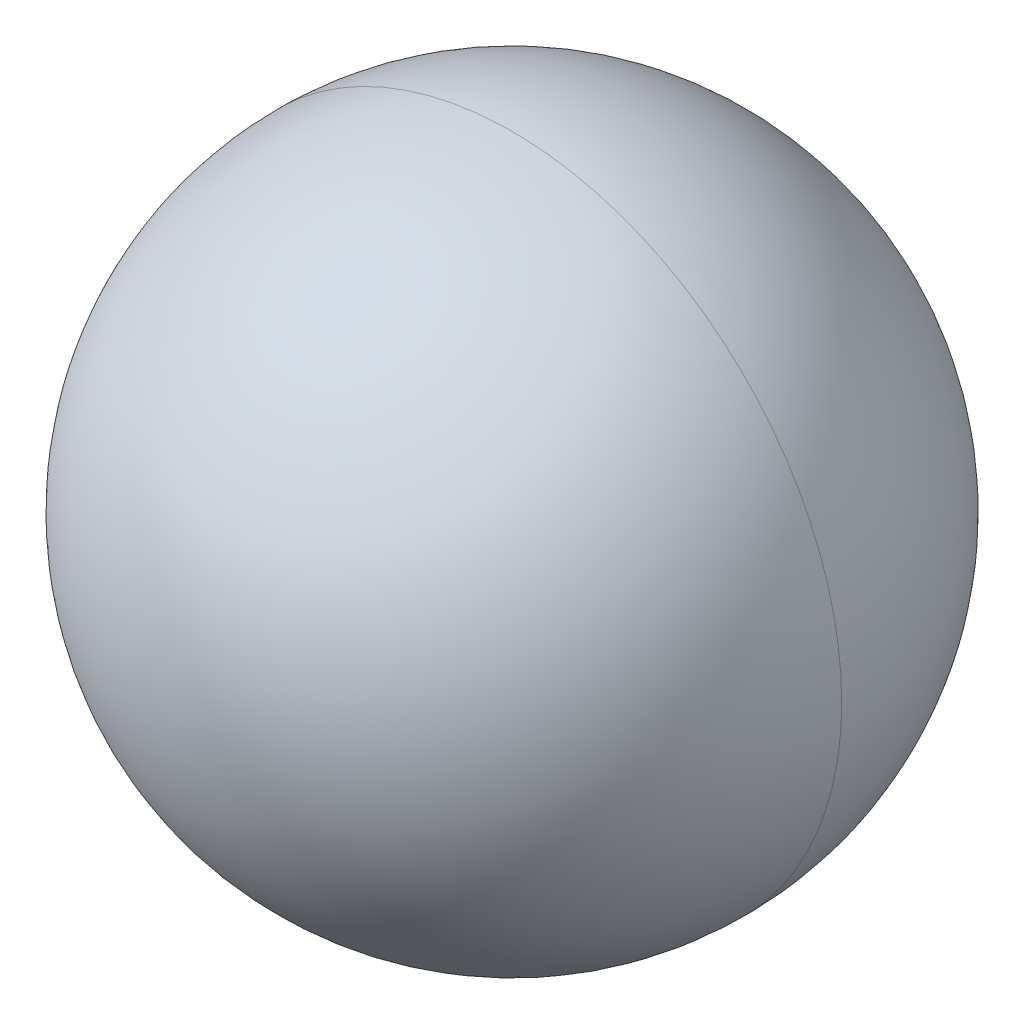
ISO-10303-21;
HEADER;
FILE_DESCRIPTION(('STEP AP214'),'2;1');
FILE_NAME('part.step','',(''),(''),'','','');
FILE_SCHEMA(('AUTOMOTIVE_DESIGN { 1 0 10303 214 1 1 1 1 }'));
ENDSEC;
DATA;
#1=APPLICATION_CONTEXT('core data for automotive mechanical design processes');
#2=APPLICATION_PROTOCOL_DEFINITION('international standard','automotive_design',2000,#1);
#3=PRODUCT_CONTEXT('',#1,'mechanical');
#4=PRODUCT('Part','Part','',(#3));
#5=PRODUCT_RELATED_PRODUCT_CATEGORY('part','',(#4));
#6=PRODUCT_DEFINITION_FORMATION('','',#4);
#7=PRODUCT_DEFINITION_CONTEXT('part definition',#1,'design');
#8=PRODUCT_DEFINITION('design','',#6,#7);
#9=PRODUCT_DEFINITION_SHAPE('','',#8);
#10=(LENGTH_UNIT() NAMED_UNIT(*) SI_UNIT(.MILLI.,.METRE.));
#11=(NAMED_UNIT(*) PLANE_ANGLE_UNIT() SI_UNIT($,.RADIAN.));
#12=(NAMED_UNIT(*) SI_UNIT($,.STERADIAN.) SOLID_ANGLE_UNIT());
#13=UNCERTAINTY_MEASURE_WITH_UNIT(LENGTH_MEASURE(1.E-05),#10,'distance_accuracy_value','');
#14=(GEOMETRIC_REPRESENTATION_CONTEXT(3) GLOBAL_UNCERTAINTY_ASSIGNED_CONTEXT((#13)) GLOBAL_UNIT_ASSIGNED_CONTEXT((#10,
#11,#12)) REPRESENTATION_CONTEXT('',''));
#15=CARTESIAN_POINT('',(0.,0.,0.));
#16=DIRECTION('',(0.,0.,1.));
#17=DIRECTION('',(1.,0.,0.));
#18=AXIS2_PLACEMENT_3D('',#15,#16,#17);
#19=CARTESIAN_POINT('',(0.,0.,0.));
#20=DIRECTION('',(1.,0.,0.));
#21=DIRECTION('',(0.,0.,-1.));
#22=AXIS2_PLACEMENT_3D('',#19,#20,#21);
#23=SPHERICAL_SURFACE('',#22,0.9);
#24=CARTESIAN_POINT('',(0.,0.,0.));
#25=DIRECTION('',(0.,0.,-1.));
#26=DIRECTION('',(0.,1.,0.));
#27=AXIS2_PLACEMENT_3D('',#24,#25,#26);
#28=CIRCLE('',#27,0.9);
#29=CARTESIAN_POINT('',(-0.9,0.,0.));
#30=VERTEX_POINT('',#29);
#31=CARTESIAN_POINT('',(0.9,0.,0.));
#32=VERTEX_POINT('',#31);
#33=EDGE_CURVE('E11',#30,#32,#28,.T.);
#34=ORIENTED_EDGE('',*,*,#33,.F.);
#35=CARTESIAN_POINT('',(-0.9,0.,0.));
#36=CARTESIAN_POINT('',(-0.900000312379897,-0.0147262304348004,0.));
#37=CARTESIAN_POINT('',(-0.899638575412637,-0.0294524342891335,0.));
#38=CARTESIAN_POINT('',(-0.898193245756673,-0.0588693795002173,0.));
#39=CARTESIAN_POINT('',(-0.897109653067968,-0.0735601208569679,0.));
#40=CARTESIAN_POINT('',(-0.894222854941986,-0.10287073173624,0.));
#41=CARTESIAN_POINT('',(-0.892419649504708,-0.117490601258761,0.));
#42=CARTESIAN_POINT('',(-0.888098068431898,-0.146624252760889,0.));
#43=CARTESIAN_POINT('',(-0.885579692796365,-0.161138034740496,0.));
#44=CARTESIAN_POINT('',(-0.87983381192945,-0.190024544888534,0.));
#45=CARTESIAN_POINT('',(-0.876606306698067,-0.204397273056964,0.));
#46=CARTESIAN_POINT('',(-0.869449949052112,-0.232967050768909,0.));
#47=CARTESIAN_POINT('',(-0.86552109663754,-0.247164100312424,0.));
#48=CARTESIAN_POINT('',(-0.856971507680436,-0.275348318745607,0.));
#49=CARTESIAN_POINT('',(-0.852350771137904,-0.289335487635276,0.));
#50=CARTESIAN_POINT('',(-0.842428546191534,-0.317066248470718,0.));
#51=CARTESIAN_POINT('',(-0.837127057787695,-0.330809840416492,0.));
#52=CARTESIAN_POINT('',(-0.825856100732622,-0.358020337840668,0.));
#53=CARTESIAN_POINT('',(-0.819886632081388,-0.37148724331907,0.));
#54=CARTESIAN_POINT('',(-0.807294095540811,-0.398111924855436,0.));
#55=CARTESIAN_POINT('',(-0.800671027651469,-0.411269700913398,0.));
#56=CARTESIAN_POINT('',(-0.786787248175571,-0.437244425373396,0.));
#57=CARTESIAN_POINT('',(-0.779526536589014,-0.45006137377543,0.));
#58=CARTESIAN_POINT('',(-0.764384961411477,-0.475323565772367,0.));
#59=CARTESIAN_POINT('',(-0.756504097820497,-0.487768809367269,0.));
#60=CARTESIAN_POINT('',(-0.740141204324086,-0.512257610068013,0.));
#61=CARTESIAN_POINT('',(-0.731659174418654,-0.524301167173854,0.));
#62=CARTESIAN_POINT('',(-0.714114382246508,-0.547957580912524,0.));
#63=CARTESIAN_POINT('',(-0.705051619979793,-0.559570437545354,0.));
#64=CARTESIAN_POINT('',(-0.686367196073135,-0.582337473949206,0.));
#65=CARTESIAN_POINT('',(-0.676745534433191,-0.593491653720227,0.));
#66=CARTESIAN_POINT('',(-0.656966491205737,-0.615314465004404,0.));
#67=CARTESIAN_POINT('',(-0.646809109618227,-0.625983096517559,0.));
#68=CARTESIAN_POINT('',(-0.625983096517561,-0.646809109618225,0.));
#69=CARTESIAN_POINT('',(-0.615314465004406,-0.656966491205736,0.));
#70=CARTESIAN_POINT('',(-0.593491653720229,-0.676745534433189,0.));
#71=CARTESIAN_POINT('',(-0.582337473949207,-0.68636719607313,0.));
#72=CARTESIAN_POINT('',(-0.559570437545356,-0.705051619979795,0.));
#73=CARTESIAN_POINT('',(-0.547957580912527,-0.714114382246518,0.));
#74=CARTESIAN_POINT('',(-0.524301167173855,-0.731659174418641,0.));
#75=CARTESIAN_POINT('',(-0.512257610068013,-0.740141204324041,0.));
#76=CARTESIAN_POINT('',(-0.487768809367274,-0.756504097820538,0.));
#77=CARTESIAN_POINT('',(-0.475323565772377,-0.764384961411635,0.));
#78=CARTESIAN_POINT('',(-0.450061373775425,-0.779526536588853,0.));
#79=CARTESIAN_POINT('',(-0.437244425373368,-0.786787248174973,0.));
#80=CARTESIAN_POINT('',(-0.41126970091343,-0.800671027652064,0.));
#81=CARTESIAN_POINT('',(-0.398111924855547,-0.807294095543034,0.));
#82=CARTESIAN_POINT('',(-0.371487243318963,-0.819886632079162,0.));
#83=CARTESIAN_POINT('',(-0.358020337840262,-0.82585610072432,0.));
#84=CARTESIAN_POINT('',(-0.330809840416902,-0.837127057795995,0.));
#85=CARTESIAN_POINT('',(-0.317066248472243,-0.842428546222511,0.));
#86=CARTESIAN_POINT('',(-0.289335487633756,-0.852350771106926,0.));
#87=CARTESIAN_POINT('',(-0.27534831873993,-0.856971507564825,0.));
#88=CARTESIAN_POINT('',(-0.247164100318106,-0.86552109675315,0.));
#89=CARTESIAN_POINT('',(-0.232967050790108,-0.869449949483576,0.));
#90=CARTESIAN_POINT('',(-0.20439727303577,-0.876606306266602,0.));
#91=CARTESIAN_POINT('',(-0.190024544809429,-0.879833810319201,0.));
#92=CARTESIAN_POINT('',(-0.161138034819605,-0.885579694406613,0.));
#93=CARTESIAN_POINT('',(-0.146624253056121,-0.888098074441426,0.));
#94=CARTESIAN_POINT('',(-0.117490600963534,-0.892419643495179,0.));
#95=CARTESIAN_POINT('',(-0.102870730634432,-0.894222832514118,0.));
#96=CARTESIAN_POINT('',(-0.0735601219587809,-0.897109675495836,0.));
#97=CARTESIAN_POINT('',(-0.0588693836122326,-0.898193329458614,0.));
#98=CARTESIAN_POINT('',(-0.0294524301771234,-0.899638491710696,0.));
#99=CARTESIAN_POINT('',(-0.0147262150885626,-0.9,0.));
#100=CARTESIAN_POINT('',(0.0147262150885591,-0.9,0.));
#101=CARTESIAN_POINT('',(0.0294524301771198,-0.899638491710696,0.));
#102=CARTESIAN_POINT('',(0.058869383612229,-0.898193329458614,0.));
#103=CARTESIAN_POINT('',(0.0735601219587774,-0.897109675495836,0.));
#104=CARTESIAN_POINT('',(0.102870730634428,-0.894222832514119,0.));
#105=CARTESIAN_POINT('',(0.117490600963531,-0.892419643495179,0.));
#106=CARTESIAN_POINT('',(0.146624253056117,-0.888098074441427,0.));
#107=CARTESIAN_POINT('',(0.161138034819601,-0.885579694406614,0.));
#108=CARTESIAN_POINT('',(0.190024544809426,-0.879833810319202,0.));
#109=CARTESIAN_POINT('',(0.204397273035767,-0.876606306266603,0.));
#110=CARTESIAN_POINT('',(0.232967050790105,-0.869449949483577,0.));
#111=CARTESIAN_POINT('',(0.247164100318102,-0.865521096753151,0.));
#112=CARTESIAN_POINT('',(0.275348318739926,-0.856971507564826,0.));
#113=CARTESIAN_POINT('',(0.289335487633753,-0.852350771106927,0.));
#114=CARTESIAN_POINT('',(0.317066248472239,-0.842428546222512,0.));
#115=CARTESIAN_POINT('',(0.330809840416899,-0.837127057795996,0.));
#116=CARTESIAN_POINT('',(0.358020337840259,-0.825856100724322,0.));
#117=CARTESIAN_POINT('',(0.37148724331896,-0.819886632079164,0.));
#118=CARTESIAN_POINT('',(0.398111924855544,-0.807294095543036,0.));
#119=CARTESIAN_POINT('',(0.411269700913426,-0.800671027652066,0.));
#120=CARTESIAN_POINT('',(0.437244425373365,-0.786787248174975,0.));
#121=CARTESIAN_POINT('',(0.450061373775421,-0.779526536588855,0.));
#122=CARTESIAN_POINT('',(0.475323565772374,-0.764384961411637,0.));
#123=CARTESIAN_POINT('',(0.487768809367271,-0.756504097820541,0.));
#124=CARTESIAN_POINT('',(0.51225761006801,-0.740141204324043,0.));
#125=CARTESIAN_POINT('',(0.524301167173852,-0.731659174418643,0.));
#126=CARTESIAN_POINT('',(0.547957580912524,-0.71411438224652,0.));
#127=CARTESIAN_POINT('',(0.559570437545354,-0.705051619979797,0.));
#128=CARTESIAN_POINT('',(0.582337473949205,-0.686367196073132,0.));
#129=CARTESIAN_POINT('',(0.593491653720226,-0.676745534433191,0.));
#130=CARTESIAN_POINT('',(0.615314465004403,-0.656966491205738,0.));
#131=CARTESIAN_POINT('',(0.625983096517558,-0.646809109618227,0.));
#132=CARTESIAN_POINT('',(0.646809109618224,-0.625983096517561,0.));
#133=CARTESIAN_POINT('',(0.656966491205734,-0.615314465004407,0.));
#134=CARTESIAN_POINT('',(0.676745534433189,-0.59349165372023,0.));
#135=CARTESIAN_POINT('',(0.686367196073132,-0.582337473949208,0.));
#136=CARTESIAN_POINT('',(0.705051619979791,-0.559570437545357,0.));
#137=CARTESIAN_POINT('',(0.714114382246506,-0.547957580912527,0.));
#138=CARTESIAN_POINT('',(0.731659174418652,-0.524301167173856,0.));
#139=CARTESIAN_POINT('',(0.740141204324084,-0.512257610068015,0.));
#140=CARTESIAN_POINT('',(0.756504097820495,-0.487768809367272,0.));
#141=CARTESIAN_POINT('',(0.764384961411475,-0.47532356577237,0.));
#142=CARTESIAN_POINT('',(0.779526536589012,-0.450061373775433,0.));
#143=CARTESIAN_POINT('',(0.786787248175569,-0.437244425373399,0.));
#144=CARTESIAN_POINT('',(0.800671027651468,-0.411269700913401,0.));
#145=CARTESIAN_POINT('',(0.80729409554081,-0.398111924855439,0.));
#146=CARTESIAN_POINT('',(0.819886632081386,-0.371487243319074,0.));
#147=CARTESIAN_POINT('',(0.825856100732621,-0.358020337840671,0.));
#148=CARTESIAN_POINT('',(0.837127057787694,-0.330809840416495,0.));
#149=CARTESIAN_POINT('',(0.842428546191532,-0.317066248470721,0.));
#150=CARTESIAN_POINT('',(0.852350771137903,-0.289335487635279,0.));
#151=CARTESIAN_POINT('',(0.856971507680435,-0.27534831874561,0.));
#152=CARTESIAN_POINT('',(0.86552109663754,-0.247164100312427,0.));
#153=CARTESIAN_POINT('',(0.869449949052112,-0.232967050768912,0.));
#154=CARTESIAN_POINT('',(0.876606306698066,-0.204397273056967,0.));
#155=CARTESIAN_POINT('',(0.879833811929449,-0.190024544888537,0.));
#156=CARTESIAN_POINT('',(0.885579692796365,-0.161138034740499,0.));
#157=CARTESIAN_POINT('',(0.888098068431897,-0.146624252760892,0.));
#158=CARTESIAN_POINT('',(0.892419649504708,-0.117490601258764,0.));
#159=CARTESIAN_POINT('',(0.894222854941986,-0.102870731736243,0.));
#160=CARTESIAN_POINT('',(0.897109653067968,-0.0735601208569719,0.));
#161=CARTESIAN_POINT('',(0.898193245756673,-0.0588693795002213,0.));
#162=CARTESIAN_POINT('',(0.899638575412637,-0.0294524342891374,0.));
#163=CARTESIAN_POINT('',(0.900000312379897,-0.0147262304348041,0.));
#164=CARTESIAN_POINT('',(0.9,0.,0.));
#165=B_SPLINE_CURVE_WITH_KNOTS('',3,(#35,#36,#37,#38,#39,#40,#41,#42,#43,#44,#45,#46,#47,#48,
#49,#50,#51,#52,#53,#54,#55,#56,#57,#58,#59,#60,#61,#62,#63,#64,#65,#66,#67,#68,#69,#70,#71,#72,
#73,#74,#75,#76,#77,#78,#79,#80,#81,#82,#83,#84,#85,#86,#87,#88,#89,#90,#91,#92,#93,#94,#95,#96,
#97,#98,#99,#100,#101,#102,#103,#104,#105,#106,#107,#108,#109,#110,#111,#112,#113,#114,#115,
#116,#117,#118,#119,#120,#121,#122,#123,#124,#125,#126,#127,#128,#129,#130,#131,#132,#133,#134,
#135,#136,#137,#138,#139,#140,#141,#142,#143,#144,#145,#146,#147,#148,#149,#150,#151,#152,#153,
#154,#155,#156,#157,#158,#159,#160,#161,#162,#163,#164),.UNSPECIFIED.,.F.,.F.,(4,2,2,2,2,2,2,2,
2,2,2,2,2,2,2,2,2,2,2,2,2,2,2,2,2,2,2,2,2,2,2,2,2,2,2,2,2,2,2,2,2,2,2,2,2,2,2,2,2,2,2,2,2,2,2,2,
2,2,2,2,2,2,2,2,4),(0.,0.044174211341242,0.0883484226824841,0.132522634023726,0.176696845364968,
0.22087105670621,0.265045268047453,0.309219479388695,0.353393690729937,0.397567902071179,
0.441742113412421,0.485916324753663,0.530090536094905,0.574264747436147,0.618438958777389,
0.662613170118631,0.706787381459873,0.750961592801115,0.795135804142358,0.8393100154836,
0.883484226824842,0.927658438166084,0.971832649507326,1.01600686084857,1.06018107218981,
1.10435528353105,1.14852949487229,1.19270370621354,1.23687791755478,1.28105212889602,
1.32522634023726,1.3694005515785,1.41357476291975,1.45774897426099,1.50192318560223,
1.54609739694347,1.59027160828472,1.63444581962596,1.6786200309672,1.72279424230844,
1.76696845364968,1.81114266499093,1.85531687633217,1.89949108767341,1.94366529901465,
1.98783951035589,2.03201372169714,2.07618793303838,2.12036214437962,2.16453635572086,
2.2087105670621,2.25288477840335,2.29705898974459,2.34123320108583,2.38540741242707,
2.42958162376831,2.47375583510956,2.5179300464508,2.56210425779204,2.60627846913328,
2.65045268047453,2.69462689181577,2.73880110315701,2.78297531449825,2.82714952583949),.UNSPECIFIED.);
#166=EDGE_CURVE('E26',#30,#32,#165,.T.);
#167=ORIENTED_EDGE('',*,*,#166,.T.);
#168=EDGE_LOOP('',(#34,#167));
#169=FACE_BOUND('',#168,.T.);
#170=ADVANCED_FACE('F17',(#169),#23,.T.);
#171=CARTESIAN_POINT('',(0.,0.,0.));
#172=DIRECTION('',(1.,0.,0.));
#173=DIRECTION('',(0.,0.,1.));
#174=AXIS2_PLACEMENT_3D('',#171,#172,#173);
#175=SPHERICAL_SURFACE('',#174,0.9);
#176=ORIENTED_EDGE('',*,*,#33,.T.);
#177=ORIENTED_EDGE('',*,*,#166,.F.);
#178=EDGE_LOOP('',(#176,#177));
#179=FACE_BOUND('',#178,.T.);
#180=ADVANCED_FACE('F36',(#179),#175,.T.);
#181=CLOSED_SHELL('',(#170,#180));
#182=MANIFOLD_SOLID_BREP('B1',#181);
#183=ADVANCED_BREP_SHAPE_REPRESENTATION('',(#18,#182),#14);
#184=SHAPE_DEFINITION_REPRESENTATION(#9,#183);
ENDSEC;
END-ISO-10303-21;
